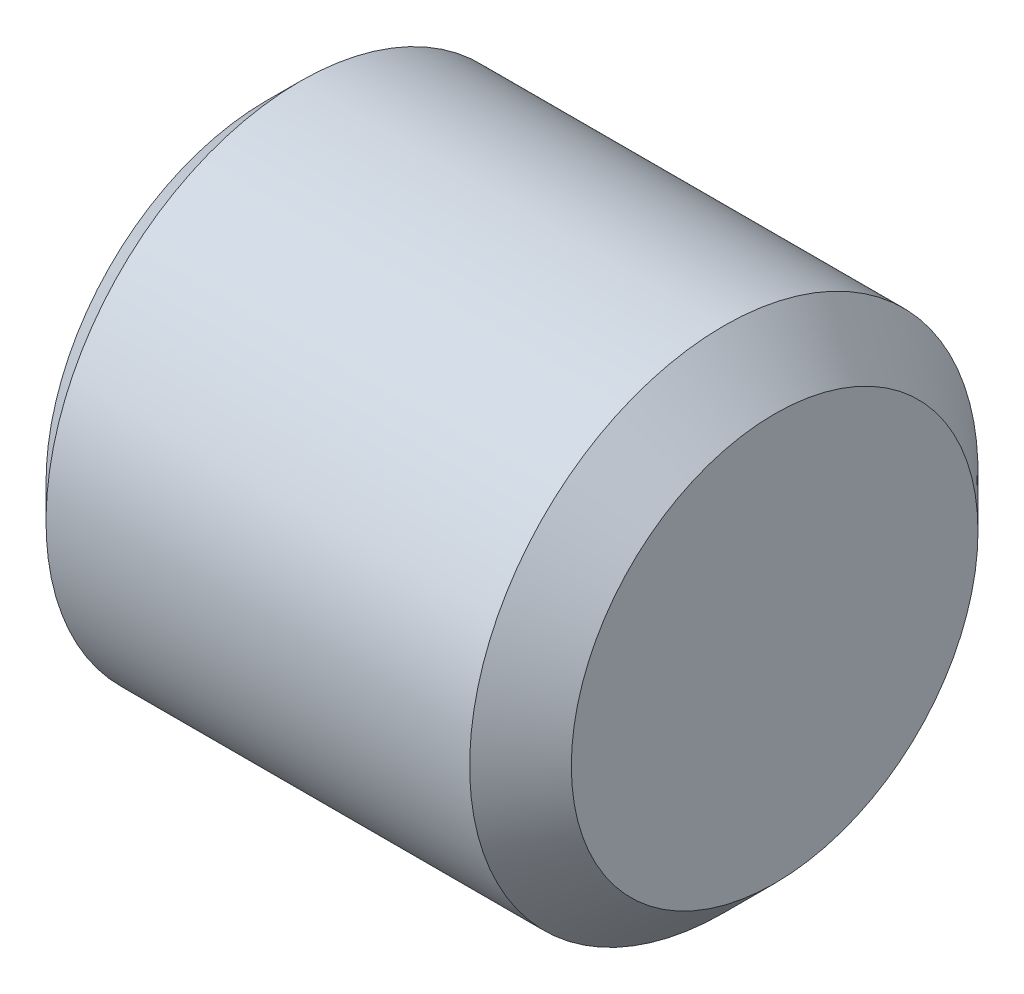
ISO-10303-21;
HEADER;
FILE_DESCRIPTION(('STEP AP214'),'2;1');
FILE_NAME('part.step','',(''),(''),'','','');
FILE_SCHEMA(('AUTOMOTIVE_DESIGN { 1 0 10303 214 1 1 1 1 }'));
ENDSEC;
DATA;
#1=APPLICATION_CONTEXT('core data for automotive mechanical design processes');
#2=APPLICATION_PROTOCOL_DEFINITION('international standard','automotive_design',2000,#1);
#3=PRODUCT_CONTEXT('',#1,'mechanical');
#4=PRODUCT('Part','Part','',(#3));
#5=PRODUCT_RELATED_PRODUCT_CATEGORY('part','',(#4));
#6=PRODUCT_DEFINITION_FORMATION('','',#4);
#7=PRODUCT_DEFINITION_CONTEXT('part definition',#1,'design');
#8=PRODUCT_DEFINITION('design','',#6,#7);
#9=PRODUCT_DEFINITION_SHAPE('','',#8);
#10=(LENGTH_UNIT() NAMED_UNIT(*) SI_UNIT(.MILLI.,.METRE.));
#11=(NAMED_UNIT(*) PLANE_ANGLE_UNIT() SI_UNIT($,.RADIAN.));
#12=(NAMED_UNIT(*) SI_UNIT($,.STERADIAN.) SOLID_ANGLE_UNIT());
#13=UNCERTAINTY_MEASURE_WITH_UNIT(LENGTH_MEASURE(1.E-05),#10,'distance_accuracy_value','');
#14=(GEOMETRIC_REPRESENTATION_CONTEXT(3) GLOBAL_UNCERTAINTY_ASSIGNED_CONTEXT((#13)) GLOBAL_UNIT_ASSIGNED_CONTEXT((#10,
#11,#12)) REPRESENTATION_CONTEXT('',''));
#15=CARTESIAN_POINT('',(0.,0.,0.));
#16=DIRECTION('',(0.,0.,1.));
#17=DIRECTION('',(1.,0.,0.));
#18=AXIS2_PLACEMENT_3D('',#15,#16,#17);
#19=CARTESIAN_POINT('',(-4.83277955606647,-17.0652927135357,162.630001288422));
#20=DIRECTION('',(-0.999999999989519,4.50844506552654E-06,7.97202140545538E-07));
#21=DIRECTION('',(-4.50844506552797E-06,-0.999999999989837,0.));
#22=AXIS2_PLACEMENT_3D('',#19,#20,#21);
#23=CONICAL_SURFACE('',#22,0.871221556250325,1.2217299999649);
#24=CARTESIAN_POINT('',(-4.83088749410857,-16.7683095051933,161.816490144292));
#25=CARTESIAN_POINT('',(-4.82435850720284,-16.7452831085532,161.843985770406));
#26=CARTESIAN_POINT('',(-4.81841927440381,-16.7221807826516,161.871572060208));
#27=CARTESIAN_POINT('',(-4.80797011107101,-16.6758259246114,161.926923993063));
#28=CARTESIAN_POINT('',(-4.80346129874667,-16.6525732893881,161.954689759203));
#29=CARTESIAN_POINT('',(-4.79616838943035,-16.6061758375144,162.010092538465));
#30=CARTESIAN_POINT('',(-4.79336838746362,-16.5830320803311,162.037728286559));
#31=CARTESIAN_POINT('',(-4.78961272073695,-16.536690441355,162.09306440396));
#32=CARTESIAN_POINT('',(-4.7886563645473,-16.5134925831212,162.120764745137));
#33=CARTESIAN_POINT('',(-4.78865612339112,-16.4670968583934,162.176165428584));
#34=CARTESIAN_POINT('',(-4.78961223841222,-16.4438989918994,162.203865770854));
#35=CARTESIAN_POINT('',(-4.79336742250759,-16.3975573201414,162.259201892952));
#36=CARTESIAN_POINT('',(-4.79616718301214,-16.3744135384304,162.286837644653));
#37=CARTESIAN_POINT('',(-4.80345960682899,-16.3280160224475,162.342240433574));
#38=CARTESIAN_POINT('',(-4.80796817511475,-16.3047633475017,162.37000620579));
#39=CARTESIAN_POINT('',(-4.81841685035814,-16.2584083972316,162.425358152932));
#40=CARTESIAN_POINT('',(-4.8243558391041,-16.2353060188325,162.452944450944));
#41=CARTESIAN_POINT('',(-4.83088458189843,-16.2122795643496,162.480440086241));
#42=B_SPLINE_CURVE_WITH_KNOTS('',3,(#24,#25,#26,#27,#28,#29,#30,#31,#32,#33,#34,#35,#36,#37,#38,
#39,#40,#41),.UNSPECIFIED.,.F.,.F.,(4,2,2,2,2,2,2,2,4),(0.,0.109371548078033,0.218828386214575,
0.327250252148645,0.435631448287842,0.544012643725442,0.652434508994771,0.761891346545215,
0.871262893855539),.UNSPECIFIED.);
#43=CARTESIAN_POINT('',(-4.8308875560963,-16.7683097237883,161.816489883237));
#44=VERTEX_POINT('',#43);
#45=CARTESIAN_POINT('',(-4.8308845818989,-16.2122795643483,162.480440086241));
#46=VERTEX_POINT('',#45);
#47=EDGE_CURVE('E111',#44,#46,#42,.T.);
#48=ORIENTED_EDGE('',*,*,#47,.F.);
#49=CARTESIAN_POINT('',(-4.83089134456941,-17.621323100119,161.966050822891));
#50=CARTESIAN_POINT('',(-4.82436231394704,-17.5859979609274,161.959857156327));
#51=CARTESIAN_POINT('',(-4.81842303787016,-17.5505563388615,161.953643067429));
#52=CARTESIAN_POINT('',(-4.80797378983316,-17.4794426641633,161.941174489862));
#53=CARTESIAN_POINT('',(-4.80346493608907,-17.4437704533889,161.934919973467));
#54=CARTESIAN_POINT('',(-4.7961719473283,-17.3725914422569,161.92243994529));
#55=CARTESIAN_POINT('',(-4.79337190727698,-17.3370862672119,161.916214718453));
#56=CARTESIAN_POINT('',(-4.78961616825805,-17.2659928879177,161.903749709964));
#57=CARTESIAN_POINT('',(-4.7886597778563,-17.2304047198092,161.897509934646));
#58=CARTESIAN_POINT('',(-4.78865947275452,-17.1592283752364,161.885030385583));
#59=CARTESIAN_POINT('',(-4.78961555804855,-17.1236401987721,161.878790611837));
#60=CARTESIAN_POINT('',(-4.79337068715238,-17.0525467864107,161.866325609474));
#61=CARTESIAN_POINT('',(-4.79617042239678,-17.0170415866482,161.860100387195));
#62=CARTESIAN_POINT('',(-4.80346279941064,-16.9458625109718,161.847620370858));
#63=CARTESIAN_POINT('',(-4.80797134622277,-16.9101902602287,161.841365861772));
#64=CARTESIAN_POINT('',(-4.81841998161803,-16.8390764927759,161.828897301121));
#65=CARTESIAN_POINT('',(-4.82435895198322,-16.8036348179338,161.822683221828));
#66=CARTESIAN_POINT('',(-4.83088767748585,-16.7683096206281,161.816489565807));
#67=B_SPLINE_CURVE_WITH_KNOTS('',3,(#49,#50,#51,#52,#53,#54,#55,#56,#57,#58,#59,#60,#61,#62,#63,
#64,#65,#66),.UNSPECIFIED.,.F.,.F.,(4,2,2,2,2,2,2,2,4),(0.,0.109371677249815,0.218828645048164,
0.327250637316203,0.435631959566625,0.544013281480483,0.652435273429601,0.761892240946784,
0.871263917828301),.UNSPECIFIED.);
#68=CARTESIAN_POINT('',(-4.83089134456954,-17.6213207508514,161.966050410987));
#69=VERTEX_POINT('',#68);
#70=EDGE_CURVE('E85',#69,#44,#67,.T.);
#71=ORIENTED_EDGE('',*,*,#70,.F.);
#72=CARTESIAN_POINT('',(-4.83089203496556,-17.9183058797835,162.779562487575));
#73=CARTESIAN_POINT('',(-4.82436313259582,-17.9060071977194,162.745873171237));
#74=CARTESIAN_POINT('',(-4.81842398472559,-17.8936679595907,162.712072769237));
#75=CARTESIAN_POINT('',(-4.80797499272413,-17.8689092531057,162.644252212947));
#76=CARTESIAN_POINT('',(-4.80346626680765,-17.8564897296878,162.610231907845));
#77=CARTESIAN_POINT('',(-4.79617353160211,-17.8317082665445,162.542349056753));
#78=CARTESIAN_POINT('',(-4.79337361729663,-17.8193468927296,162.508488060728));
#79=CARTESIAN_POINT('',(-4.78961812849956,-17.7945952324381,162.440686893761));
#80=CARTESIAN_POINT('',(-4.78866186257504,-17.7822049585461,162.406746757283));
#81=CARTESIAN_POINT('',(-4.7886618049677,-17.7574244021398,162.338866485852));
#82=CARTESIAN_POINT('',(-4.78961801328488,-17.7450341196255,162.304926350899));
#83=CARTESIAN_POINT('',(-4.79337338700153,-17.7202824254717,162.237125189919));
#84=CARTESIAN_POINT('',(-4.79617324383399,-17.7079210264106,162.203264198358));
#85=CARTESIAN_POINT('',(-4.80346586382044,-17.68313949751,162.135381358893));
#86=CARTESIAN_POINT('',(-4.80797453199349,-17.6707199334376,162.10136106098));
#87=CARTESIAN_POINT('',(-4.81842340888157,-17.6459611327357,162.033540521351));
#88=CARTESIAN_POINT('',(-4.82436249938159,-17.6336218410547,161.999740128819));
#89=CARTESIAN_POINT('',(-4.83089134456967,-17.6213231001205,161.966050822891));
#90=B_SPLINE_CURVE_WITH_KNOTS('',3,(#72,#73,#74,#75,#76,#77,#78,#79,#80,#81,#82,#83,#84,#85,#86,
#87,#88,#89),.UNSPECIFIED.,.F.,.F.,(4,2,2,2,2,2,2,2,4),(0.,0.109371635122591,0.218828560693699,
0.327250511787922,0.435631792924831,0.544013074061714,0.652435025155926,0.761891950727031,
0.871263585849605),.UNSPECIFIED.);
#91=CARTESIAN_POINT('',(-4.83089203496414,-17.9183058797794,162.779562487575));
#92=VERTEX_POINT('',#91);
#93=EDGE_CURVE('E19',#92,#69,#90,.T.);
#94=ORIENTED_EDGE('',*,*,#93,.F.);
#95=CARTESIAN_POINT('',(-4.83088914144967,-17.3622749985359,163.443513552444));
#96=CARTESIAN_POINT('',(-4.82436037889523,-17.3853014915838,163.416017871096));
#97=CARTESIAN_POINT('',(-4.8184213714326,-17.4084039088072,163.388431526725));
#98=CARTESIAN_POINT('',(-4.80797266221982,-17.4547589373908,163.33307948607));
#99=CARTESIAN_POINT('',(-4.80346407869076,-17.4780116518271,163.305313666698));
#100=CARTESIAN_POINT('',(-4.79617162955145,-17.5244092463065,163.249910784045));
#101=CARTESIAN_POINT('',(-4.79337185887487,-17.5475530670156,163.222274985777));
#102=CARTESIAN_POINT('',(-4.7896166604361,-17.5938948170454,163.166938770215));
#103=CARTESIAN_POINT('',(-4.78866054123725,-17.617092722813,163.13923838105));
#104=CARTESIAN_POINT('',(-4.78866078055539,-17.6634885261426,163.083837603745));
#105=CARTESIAN_POINT('',(-4.78961713908664,-17.6866864237046,163.056137215606));
#106=CARTESIAN_POINT('',(-4.79337281661789,-17.7330281411155,163.000801004547));
#107=CARTESIAN_POINT('',(-4.79617282705396,-17.7561719374052,162.973165209755));
#108=CARTESIAN_POINT('',(-4.8034657584948,-17.8025694680239,162.917762336465));
#109=CARTESIAN_POINT('',(-4.80797458456911,-17.8258221428782,162.889996523002));
#110=CARTESIAN_POINT('',(-4.81842377913439,-17.8721770795315,162.834644496276));
#111=CARTESIAN_POINT('',(-4.82436302940666,-17.8952794444164,162.807058159924));
#112=CARTESIAN_POINT('',(-4.83089203496302,-17.9183058797764,162.779562487575));
#113=B_SPLINE_CURVE_WITH_KNOTS('',3,(#95,#96,#97,#98,#99,#100,#101,#102,#103,#104,#105,#106,
#107,#108,#109,#110,#111,#112),.UNSPECIFIED.,.F.,.F.,(4,2,2,2,2,2,2,2,4),(0.,0.109371735303198,
0.218828761503834,0.327250810609819,0.435632189571556,0.544013569340722,0.652435619211819,
0.761892646087013,0.871264382273772),.UNSPECIFIED.);
#114=CARTESIAN_POINT('',(-4.83088907013832,-17.3622752501289,163.443513252019));
#115=VERTEX_POINT('',#114);
#116=EDGE_CURVE('E123',#115,#92,#113,.T.);
#117=ORIENTED_EDGE('',*,*,#116,.F.);
#118=CARTESIAN_POINT('',(-4.83088538574785,-16.5092613708116,163.293951666565));
#119=CARTESIAN_POINT('',(-4.82435669126518,-16.5445865916919,163.300145271431));
#120=CARTESIAN_POINT('',(-4.81841772804385,-16.5800282808185,163.30635933055));
#121=CARTESIAN_POINT('',(-4.80796908555114,-16.6511420693164,163.318827878281));
#122=CARTESIAN_POINT('',(-4.80346052449975,-16.6868143268162,163.325082394643));
#123=CARTESIAN_POINT('',(-4.79616812428154,-16.7579934188786,163.337562418265));
#124=CARTESIAN_POINT('',(-4.79336838003915,-16.7934986282474,163.343787640622));
#125=CARTESIAN_POINT('',(-4.78961323182628,-16.8645920595481,163.356252645129));
#126=CARTESIAN_POINT('',(-4.78865713641161,-16.9001802453448,163.362492420941));
#127=CARTESIAN_POINT('',(-4.78865742271244,-16.97135661038,163.374971973907));
#128=CARTESIAN_POINT('',(-4.78961380449543,-17.0069447896183,163.381211751061));
#129=CARTESIAN_POINT('',(-4.79336952792556,-17.0780381916016,163.393676763444));
#130=CARTESIAN_POINT('',(-4.79616956101403,-17.1135433782056,163.399901992337));
#131=CARTESIAN_POINT('',(-4.8034625377839,-17.1847224123707,163.412382024577));
#132=CARTESIAN_POINT('',(-4.80797138650392,-17.220394634622,163.418636542978));
#133=CARTESIAN_POINT('',(-4.81842062633963,-17.2915083320646,163.431105124521));
#134=CARTESIAN_POINT('',(-4.82435989923127,-17.3269499653991,163.437319215389));
#135=CARTESIAN_POINT('',(-4.83088892751334,-17.3622751157546,163.443512883922));
#136=B_SPLINE_CURVE_WITH_KNOTS('',3,(#118,#119,#120,#121,#122,#123,#124,#125,#126,#127,#128,
#129,#130,#131,#132,#133,#134,#135),.UNSPECIFIED.,.F.,.F.,(4,2,2,2,2,2,2,2,4),(0.,
0.109371704811972,0.218828701705132,0.327250723799824,0.435632075258599,0.544013430541816,
0.652435456241326,0.761892456789523,0.871264166263111),.UNSPECIFIED.);
#137=CARTESIAN_POINT('',(-4.83088535982278,-16.5092618702694,163.293951667867));
#138=VERTEX_POINT('',#137);
#139=EDGE_CURVE('E122',#138,#115,#136,.T.);
#140=ORIENTED_EDGE('',*,*,#139,.F.);
#141=CARTESIAN_POINT('',(-4.8308845818996,-16.2122795643462,162.480440086242));
#142=CARTESIAN_POINT('',(-4.82435574042066,-16.2245782983092,162.514129373074));
#143=CARTESIAN_POINT('',(-4.81841665295172,-16.236917582968,162.54792974637));
#144=CARTESIAN_POINT('',(-4.80796778036208,-16.2616763695335,162.615750247276));
#145=CARTESIAN_POINT('',(-4.80345911345373,-16.2740959264916,162.649770525702));
#146=CARTESIAN_POINT('',(-4.79616649377176,-16.2988774412922,162.717653326543));
#147=CARTESIAN_POINT('',(-4.79336663601444,-16.3112388333685,162.751514298971));
#148=CARTESIAN_POINT('',(-4.78961125814352,-16.3359905135763,162.819315421749));
#149=CARTESIAN_POINT('',(-4.78865504659892,-16.3483807891294,162.853255537633));
#150=CARTESIAN_POINT('',(-4.78865509560191,-16.3731613317499,162.921135771301));
#151=CARTESIAN_POINT('',(-4.78961135615825,-16.3855515988173,162.955075889085));
#152=CARTESIAN_POINT('',(-4.79336683254324,-16.4103032455704,163.022877018966));
#153=CARTESIAN_POINT('',(-4.79616673980262,-16.4226646126715,163.056737996601));
#154=CARTESIAN_POINT('',(-4.80345945973253,-16.4474460623366,163.124620810773));
#155=CARTESIAN_POINT('',(-4.80796817739321,-16.4598655789918,163.15864109735));
#156=CARTESIAN_POINT('',(-4.81841715228285,-16.4846242720901,163.22646161697));
#157=CARTESIAN_POINT('',(-4.8243562913005,-16.4969635035946,163.260262000824));
#158=CARTESIAN_POINT('',(-4.83088518476647,-16.509262179075,163.293951299128));
#159=B_SPLINE_CURVE_WITH_KNOTS('',3,(#141,#142,#143,#144,#145,#146,#147,#148,#149,#150,#151,
#152,#153,#154,#155,#156,#157,#158),.UNSPECIFIED.,.F.,.F.,(4,2,2,2,2,2,2,2,4),(0.,
0.109371573100633,0.218828436502669,0.327250326978625,0.435631547585992,0.544012768688889,
0.652434659634366,0.761891523450345,0.871263097093267),.UNSPECIFIED.);
#160=EDGE_CURVE('E159',#46,#138,#159,.T.);
#161=ORIENTED_EDGE('',*,*,#160,.F.);
#162=EDGE_LOOP('',(#48,#71,#94,#117,#140,#161));
#163=FACE_BOUND('',#162,.T.);
#164=CARTESIAN_POINT('',(-4.51568037209427,-17.0652941431797,162.630001035666));
#165=VERTEX_POINT('',#164);
#166=VERTEX_LOOP('',#165);
#167=FACE_BOUND('',#166,.T.);
#168=ADVANCED_FACE('F15',(#163,#167),#23,.F.);
#169=CARTESIAN_POINT('',(-14.21660372641,-17.91826356482,162.77956996989));
#170=DIRECTION('',(4.50844506552477E-06,0.939362357181745,0.342926175567907));
#171=DIRECTION('',(0.,-0.342926175571392,0.939362357191291));
#172=AXIS2_PLACEMENT_3D('',#169,#170,#171);
#173=PLANE('',#172);
#174=ORIENTED_EDGE('',*,*,#93,.T.);
#175=DIRECTION('',(0.999999999998777,-2.70070112790202E-07,-1.54032836522896E-06));
#176=VECTOR('',#175,1.);
#177=CARTESIAN_POINT('',(-14.21660303602,-17.6213146921486,161.96606425021));
#178=LINE('',#177,#176);
#179=CARTESIAN_POINT('',(-6.21660303610415,-17.6213168527103,161.966051927583));
#180=VERTEX_POINT('',#179);
#181=EDGE_CURVE('E80',#180,#69,#178,.T.);
#182=ORIENTED_EDGE('',*,*,#181,.F.);
#183=DIRECTION('',(-7.97202141119968E-07,-0.342926175572562,0.939362357190526));
#184=VECTOR('',#183,1.);
#185=CARTESIAN_POINT('',(-6.21660303610415,-17.62131685271,161.96605192758));
#186=LINE('',#185,#184);
#187=CARTESIAN_POINT('',(-6.2166037265013,-17.9183006720814,162.779562350768));
#188=VERTEX_POINT('',#187);
#189=EDGE_CURVE('E77',#180,#188,#186,.T.);
#190=ORIENTED_EDGE('',*,*,#189,.T.);
#191=DIRECTION('',(0.999999999995665,-2.25753390147231E-06,1.89058897727454E-06));
#192=VECTOR('',#191,1.);
#193=CARTESIAN_POINT('',(-14.21660069028,-17.9182846912198,162.779544743059));
#194=LINE('',#193,#192);
#195=EDGE_CURVE('E120',#92,#188,#194,.F.);
#196=ORIENTED_EDGE('',*,*,#195,.F.);
#197=EDGE_LOOP('',(#174,#182,#190,#196));
#198=FACE_BOUND('',#197,.T.);
#199=ADVANCED_FACE('F82',(#198),#173,.T.);
#200=CARTESIAN_POINT('',(-14.21660069028,-17.36223318676,163.4435204339));
#201=DIRECTION('',(2.94461983917938E-06,0.766663958255359,-0.642048576903301));
#202=DIRECTION('',(0.,0.642048576906085,0.766663958258683));
#203=AXIS2_PLACEMENT_3D('',#200,#201,#202);
#204=PLANE('',#203);
#205=ORIENTED_EDGE('',*,*,#116,.T.);
#206=ORIENTED_EDGE('',*,*,#195,.T.);
#207=DIRECTION('',(3.50582688797202E-06,0.642048576891251,0.76666395826309));
#208=VECTOR('',#207,1.);
#209=CARTESIAN_POINT('',(-6.21660372650145,-17.91829963238,162.77956359227));
#210=LINE('',#209,#208);
#211=CARTESIAN_POINT('',(-6.21660069036631,-17.3622692543237,163.443514056288));
#212=VERTEX_POINT('',#211);
#213=EDGE_CURVE('E99',#188,#212,#210,.T.);
#214=ORIENTED_EDGE('',*,*,#213,.T.);
#215=DIRECTION('',(-0.999999999989519,4.50844506553466E-06,7.97202141370399E-07));
#216=VECTOR('',#215,1.);
#217=CARTESIAN_POINT('',(-14.21660069028,-17.3622331867564,163.443520433904));
#218=LINE('',#217,#216);
#219=EDGE_CURVE('E166',#115,#212,#218,.T.);
#220=ORIENTED_EDGE('',*,*,#219,.F.);
#221=EDGE_LOOP('',(#205,#206,#214,#220));
#222=FACE_BOUND('',#221,.T.);
#223=ADVANCED_FACE('F177',(#222),#204,.T.);
#224=CARTESIAN_POINT('',(-14.21659696375,-16.50922002905,163.29395923324));
#225=DIRECTION('',(-1.56382522634123E-06,-0.172698398924915,-0.984974752471517));
#226=DIRECTION('',(0.,0.984974752472721,-0.172698398925126));
#227=AXIS2_PLACEMENT_3D('',#224,#225,#226);
#228=PLANE('',#227);
#229=ORIENTED_EDGE('',*,*,#139,.T.);
#230=ORIENTED_EDGE('',*,*,#219,.T.);
#231=DIRECTION('',(4.30302902905743E-06,0.98497475246244,-0.172698398930156));
#232=VECTOR('',#231,1.);
#233=CARTESIAN_POINT('',(-6.21659882710008,-16.935762675466,163.368733455955));
#234=LINE('',#233,#232);
#235=CARTESIAN_POINT('',(-6.21659696383429,-16.5092562860235,163.293953374475));
#236=VERTEX_POINT('',#235);
#237=EDGE_CURVE('E101',#212,#236,#234,.T.);
#238=ORIENTED_EDGE('',*,*,#237,.T.);
#239=DIRECTION('',(0.999999999989837,-4.2350635840188E-06,-1.54606382409412E-06));
#240=VECTOR('',#239,1.);
#241=CARTESIAN_POINT('',(-14.21659627335,-16.5092225949278,163.293966261838));
#242=LINE('',#241,#240);
#243=EDGE_CURVE('E165',#138,#236,#242,.F.);
#244=ORIENTED_EDGE('',*,*,#243,.F.);
#245=EDGE_LOOP('',(#229,#230,#238,#244));
#246=FACE_BOUND('',#245,.T.);
#247=ADVANCED_FACE('F154',(#246),#228,.T.);
#248=CARTESIAN_POINT('',(-14.21659627335,-16.21223724938,162.48044756855));
#249=DIRECTION('',(-4.50844506552477E-06,-0.939362357181745,-0.342926175567907));
#250=DIRECTION('',(0.,0.342926175571392,-0.939362357191291));
#251=AXIS2_PLACEMENT_3D('',#248,#249,#250);
#252=PLANE('',#251);
#253=ORIENTED_EDGE('',*,*,#160,.T.);
#254=ORIENTED_EDGE('',*,*,#243,.T.);
#255=DIRECTION('',(7.9720214112861E-07,0.342926175576275,-0.93936235718917));
#256=VECTOR('',#255,1.);
#257=CARTESIAN_POINT('',(-6.21659696383385,-16.50925609661,163.29395285562));
#258=LINE('',#257,#256);
#259=CARTESIAN_POINT('',(-6.21659627343604,-16.2122742178163,162.480439569145));
#260=VERTEX_POINT('',#259);
#261=EDGE_CURVE('E114',#236,#260,#258,.T.);
#262=ORIENTED_EDGE('',*,*,#261,.T.);
#263=DIRECTION('',(0.999999999995665,-2.25753390146788E-06,1.89058897727378E-06));
#264=VECTOR('',#263,1.);
#265=CARTESIAN_POINT('',(-14.21659930948,-16.2122583757813,162.480422341712));
#266=LINE('',#265,#264);
#267=EDGE_CURVE('E86',#46,#260,#266,.F.);
#268=ORIENTED_EDGE('',*,*,#267,.F.);
#269=EDGE_LOOP('',(#253,#254,#262,#268));
#270=FACE_BOUND('',#269,.T.);
#271=ADVANCED_FACE('F150',(#270),#252,.T.);
#272=CARTESIAN_POINT('',(-14.21659930948,-16.76826762744,161.81649710453));
#273=DIRECTION('',(-2.94461983917549E-06,-0.766663958254867,0.642048576903889));
#274=DIRECTION('',(0.,-0.642048576906672,-0.766663958258191));
#275=AXIS2_PLACEMENT_3D('',#272,#273,#274);
#276=PLANE('',#275);
#277=ORIENTED_EDGE('',*,*,#47,.T.);
#278=ORIENTED_EDGE('',*,*,#267,.T.);
#279=DIRECTION('',(-3.50582688794603E-06,-0.642048576898037,-0.766663958257407));
#280=VECTOR('',#279,1.);
#281=CARTESIAN_POINT('',(-6.21659627343655,-16.21227331694,162.48044119094));
#282=LINE('',#281,#280);
#283=CARTESIAN_POINT('',(-6.21659930957169,-16.7683036949999,161.816490726917));
#284=VERTEX_POINT('',#283);
#285=EDGE_CURVE('E37',#260,#284,#282,.T.);
#286=ORIENTED_EDGE('',*,*,#285,.T.);
#287=DIRECTION('',(-0.999999999989519,4.50844506553203E-06,7.97202141369124E-07));
#288=VECTOR('',#287,1.);
#289=CARTESIAN_POINT('',(-14.21659930948,-16.768267627437,161.816497104534));
#290=LINE('',#289,#288);
#291=EDGE_CURVE('E91',#44,#284,#290,.T.);
#292=ORIENTED_EDGE('',*,*,#291,.F.);
#293=EDGE_LOOP('',(#277,#278,#286,#292));
#294=FACE_BOUND('',#293,.T.);
#295=ADVANCED_FACE('F145',(#294),#276,.T.);
#296=CARTESIAN_POINT('',(-14.21660303602,-17.62128078515,161.9660583052));
#297=DIRECTION('',(1.5638252263445E-06,0.172698398926056,0.984974752471317));
#298=DIRECTION('',(0.,-0.984974752472521,0.172698398926267));
#299=AXIS2_PLACEMENT_3D('',#296,#297,#298);
#300=PLANE('',#299);
#301=ORIENTED_EDGE('',*,*,#70,.T.);
#302=ORIENTED_EDGE('',*,*,#291,.T.);
#303=DIRECTION('',(-4.30302902905562E-06,-0.98497475246224,0.172698398931296));
#304=VECTOR('',#303,1.);
#305=CARTESIAN_POINT('',(-6.21660117283792,-17.194810273854,161.89127132725));
#306=LINE('',#305,#304);
#307=EDGE_CURVE('E89',#284,#180,#306,.T.);
#308=ORIENTED_EDGE('',*,*,#307,.T.);
#309=ORIENTED_EDGE('',*,*,#181,.T.);
#310=EDGE_LOOP('',(#301,#302,#308,#309));
#311=FACE_BOUND('',#310,.T.);
#312=ADVANCED_FACE('F90',(#311),#300,.T.);
#313=CARTESIAN_POINT('',(-6.216599999969,-17.06528647466,162.6300023916));
#314=DIRECTION('',(0.999999999989519,-4.50844506555083E-06,-7.97202141258916E-07));
#315=DIRECTION('',(4.50844506555226E-06,0.999999999989837,0.));
#316=AXIS2_PLACEMENT_3D('',#313,#314,#315);
#317=PLANE('',#316);
#318=ORIENTED_EDGE('',*,*,#285,.F.);
#319=ORIENTED_EDGE('',*,*,#261,.F.);
#320=ORIENTED_EDGE('',*,*,#237,.F.);
#321=ORIENTED_EDGE('',*,*,#213,.F.);
#322=ORIENTED_EDGE('',*,*,#189,.F.);
#323=ORIENTED_EDGE('',*,*,#307,.F.);
#324=EDGE_LOOP('',(#318,#319,#320,#321,#322,#323));
#325=FACE_BOUND('',#324,.T.);
#326=CARTESIAN_POINT('',(-6.21659999994205,-17.065286474661,162.6300023916));
#327=DIRECTION('',(0.999999999989519,-4.50844506574641E-06,-7.97202141059033E-07));
#328=DIRECTION('',(4.50844506574784E-06,0.999999999989837,0.));
#329=AXIS2_PLACEMENT_3D('',#326,#327,#328);
#330=CIRCLE('',#329,1.29999999999231);
#331=CARTESIAN_POINT('',(-6.21659413896346,-15.7652864746819,162.6300023916));
#332=VERTEX_POINT('',#331);
#333=EDGE_CURVE('E93',#332,#332,#330,.T.);
#334=ORIENTED_EDGE('',*,*,#333,.F.);
#335=EDGE_LOOP('',(#334));
#336=FACE_BOUND('',#335,.T.);
#337=ADVANCED_FACE('F96',(#325,#336),#317,.F.);
#338=CARTESIAN_POINT('',(-3.2166,-17.0653,162.63));
#339=DIRECTION('',(0.999999999989519,-4.50844506555083E-06,-7.97202141258916E-07));
#340=DIRECTION('',(4.50844506555226E-06,0.999999999989837,0.));
#341=AXIS2_PLACEMENT_3D('',#338,#339,#340);
#342=PLANE('',#341);
#343=CARTESIAN_POINT('',(-3.21659999990903,-17.0652999999935,162.629999999999));
#344=DIRECTION('',(-0.999999999989519,4.50844506546208E-06,7.9720214125831E-07));
#345=DIRECTION('',(-4.50844506546351E-06,-0.999999999989837,0.));
#346=AXIS2_PLACEMENT_3D('',#343,#344,#345);
#347=CIRCLE('',#346,1.20000000002183);
#348=CARTESIAN_POINT('',(-3.21660541004311,-18.2653000000032,162.629999999999));
#349=VERTEX_POINT('',#348);
#350=EDGE_CURVE('E126',#349,#349,#347,.T.);
#351=ORIENTED_EDGE('',*,*,#350,.F.);
#352=EDGE_LOOP('',(#351));
#353=FACE_BOUND('',#352,.T.);
#354=ADVANCED_FACE('F202',(#353),#342,.T.);
#355=CARTESIAN_POINT('',(-6.01660000011137,-17.06528737635,162.63000223216));
#356=DIRECTION('',(0.999999999989519,-4.50844506574641E-06,-7.97202141059033E-07));
#357=DIRECTION('',(4.50844506574784E-06,0.999999999989837,0.));
#358=AXIS2_PLACEMENT_3D('',#355,#356,#357);
#359=CONICAL_SURFACE('',#358,1.49999999985724,0.785398163477848);
#360=ORIENTED_EDGE('',*,*,#333,.T.);
#361=EDGE_LOOP('',(#360));
#362=FACE_BOUND('',#361,.T.);
#363=CARTESIAN_POINT('',(-6.01659999997021,-17.065287376349,162.63000223216));
#364=DIRECTION('',(0.999999999989519,-4.50844506555083E-06,-7.97202141258917E-07));
#365=DIRECTION('',(4.50844506555226E-06,0.999999999989837,0.));
#366=AXIS2_PLACEMENT_3D('',#363,#364,#365);
#367=CIRCLE('',#366,1.5);
#368=CARTESIAN_POINT('',(-6.01659323730261,-15.5652873763643,162.63000223216));
#369=VERTEX_POINT('',#368);
#370=EDGE_CURVE('E28',#369,#369,#367,.T.);
#371=ORIENTED_EDGE('',*,*,#370,.F.);
#372=EDGE_LOOP('',(#371));
#373=FACE_BOUND('',#372,.T.);
#374=ADVANCED_FACE('F195',(#362,#373),#359,.T.);
#375=CARTESIAN_POINT('',(-3.51659999994312,-17.06529864746,162.63000023916));
#376=DIRECTION('',(-0.999999999989519,4.50844506546208E-06,7.9720214125831E-07));
#377=DIRECTION('',(-4.50844506546351E-06,-0.999999999989837,0.));
#378=AXIS2_PLACEMENT_3D('',#375,#376,#377);
#379=CONICAL_SURFACE('',#378,1.50000000001438,0.785398163322985);
#380=CARTESIAN_POINT('',(-3.51659999999721,-17.0652986474617,162.630000239154));
#381=DIRECTION('',(0.999999999989519,-4.50844506555083E-06,-7.97202141258917E-07));
#382=DIRECTION('',(4.50844506555226E-06,0.999999999989837,0.));
#383=AXIS2_PLACEMENT_3D('',#380,#381,#382);
#384=CIRCLE('',#383,1.5);
#385=CARTESIAN_POINT('',(-3.51659323732961,-15.5652986474769,162.630000239154));
#386=VERTEX_POINT('',#385);
#387=EDGE_CURVE('E10',#386,#386,#384,.F.);
#388=ORIENTED_EDGE('',*,*,#387,.F.);
#389=EDGE_LOOP('',(#388));
#390=FACE_BOUND('',#389,.T.);
#391=ORIENTED_EDGE('',*,*,#350,.T.);
#392=EDGE_LOOP('',(#391));
#393=FACE_BOUND('',#392,.T.);
#394=ADVANCED_FACE('F189',(#390,#393),#379,.T.);
#395=CARTESIAN_POINT('',(-6.216599999969,-17.06528647466,162.6300023916));
#396=DIRECTION('',(0.999999999989519,-4.50844506555083E-06,-7.97202141258917E-07));
#397=DIRECTION('',(4.50844506555226E-06,0.999999999989837,0.));
#398=AXIS2_PLACEMENT_3D('',#395,#396,#397);
#399=CYLINDRICAL_SURFACE('',#398,1.5);
#400=ORIENTED_EDGE('',*,*,#370,.T.);
#401=EDGE_LOOP('',(#400));
#402=FACE_BOUND('',#401,.T.);
#403=ORIENTED_EDGE('',*,*,#387,.T.);
#404=EDGE_LOOP('',(#403));
#405=FACE_BOUND('',#404,.T.);
#406=ADVANCED_FACE('F187',(#402,#405),#399,.T.);
#407=CLOSED_SHELL('',(#168,#199,#223,#247,#271,#295,#312,#337,#354,#374,#394,#406));
#408=MANIFOLD_SOLID_BREP('B1',#407);
#409=ADVANCED_BREP_SHAPE_REPRESENTATION('',(#18,#408),#14);
#410=SHAPE_DEFINITION_REPRESENTATION(#9,#409);
ENDSEC;
END-ISO-10303-21;
